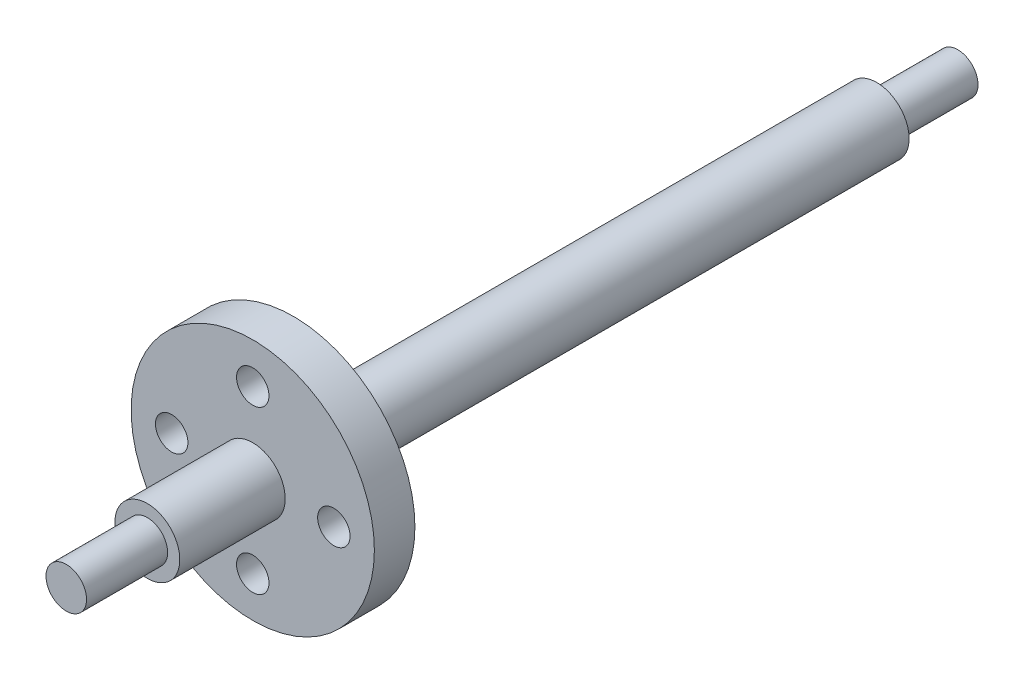
ISO-10303-21;
HEADER;
FILE_DESCRIPTION(('STEP AP214'),'2;1');
FILE_NAME('part.step','',(''),(''),'','','');
FILE_SCHEMA(('AUTOMOTIVE_DESIGN { 1 0 10303 214 1 1 1 1 }'));
ENDSEC;
DATA;
#1=APPLICATION_CONTEXT('core data for automotive mechanical design processes');
#2=APPLICATION_PROTOCOL_DEFINITION('international standard','automotive_design',2000,#1);
#3=PRODUCT_CONTEXT('',#1,'mechanical');
#4=PRODUCT('Part','Part','',(#3));
#5=PRODUCT_RELATED_PRODUCT_CATEGORY('part','',(#4));
#6=PRODUCT_DEFINITION_FORMATION('','',#4);
#7=PRODUCT_DEFINITION_CONTEXT('part definition',#1,'design');
#8=PRODUCT_DEFINITION('design','',#6,#7);
#9=PRODUCT_DEFINITION_SHAPE('','',#8);
#10=(LENGTH_UNIT() NAMED_UNIT(*) SI_UNIT(.MILLI.,.METRE.));
#11=(NAMED_UNIT(*) PLANE_ANGLE_UNIT() SI_UNIT($,.RADIAN.));
#12=(NAMED_UNIT(*) SI_UNIT($,.STERADIAN.) SOLID_ANGLE_UNIT());
#13=UNCERTAINTY_MEASURE_WITH_UNIT(LENGTH_MEASURE(1.E-05),#10,'distance_accuracy_value','');
#14=(GEOMETRIC_REPRESENTATION_CONTEXT(3) GLOBAL_UNCERTAINTY_ASSIGNED_CONTEXT((#13)) GLOBAL_UNIT_ASSIGNED_CONTEXT((#10,
#11,#12)) REPRESENTATION_CONTEXT('',''));
#15=CARTESIAN_POINT('',(0.,0.,0.));
#16=DIRECTION('',(0.,0.,1.));
#17=DIRECTION('',(1.,0.,0.));
#18=AXIS2_PLACEMENT_3D('',#15,#16,#17);
#19=CARTESIAN_POINT('',(0.,0.,109.95));
#20=DIRECTION('',(0.,0.,-1.));
#21=DIRECTION('',(-1.,0.,0.));
#22=AXIS2_PLACEMENT_3D('',#19,#20,#21);
#23=CYLINDRICAL_SURFACE('',#22,4.);
#24=CARTESIAN_POINT('',(0.,0.,86.95));
#25=DIRECTION('',(0.,0.,1.));
#26=DIRECTION('',(1.,0.,0.));
#27=AXIS2_PLACEMENT_3D('',#24,#25,#26);
#28=CIRCLE('',#27,4.);
#29=CARTESIAN_POINT('',(4.,0.,86.95));
#30=VERTEX_POINT('',#29);
#31=EDGE_CURVE('E44',#30,#30,#28,.T.);
#32=ORIENTED_EDGE('',*,*,#31,.T.);
#33=EDGE_LOOP('',(#32));
#34=FACE_BOUND('',#33,.T.);
#35=CARTESIAN_POINT('',(0.,0.,99.95));
#36=DIRECTION('',(0.,0.,-1.));
#37=DIRECTION('',(-1.,0.,0.));
#38=AXIS2_PLACEMENT_3D('',#35,#36,#37);
#39=CIRCLE('',#38,4.);
#40=CARTESIAN_POINT('',(-4.,0.,99.95));
#41=VERTEX_POINT('',#40);
#42=EDGE_CURVE('E61',#41,#41,#39,.T.);
#43=ORIENTED_EDGE('',*,*,#42,.T.);
#44=EDGE_LOOP('',(#43));
#45=FACE_BOUND('',#44,.T.);
#46=ADVANCED_FACE('F41',(#34,#45),#23,.T.);
#47=CARTESIAN_POINT('',(0.,0.,99.95));
#48=DIRECTION('',(0.,0.,1.));
#49=DIRECTION('',(-1.,0.,0.));
#50=AXIS2_PLACEMENT_3D('',#47,#48,#49);
#51=PLANE('',#50);
#52=ORIENTED_EDGE('',*,*,#42,.F.);
#53=EDGE_LOOP('',(#52));
#54=FACE_BOUND('',#53,.T.);
#55=CARTESIAN_POINT('',(0.,0.,99.95));
#56=DIRECTION('',(0.,0.,-1.));
#57=DIRECTION('',(-1.,0.,0.));
#58=AXIS2_PLACEMENT_3D('',#55,#56,#57);
#59=CIRCLE('',#58,2.5);
#60=CARTESIAN_POINT('',(-2.5,0.,99.95));
#61=VERTEX_POINT('',#60);
#62=EDGE_CURVE('E68',#61,#61,#59,.T.);
#63=ORIENTED_EDGE('',*,*,#62,.T.);
#64=EDGE_LOOP('',(#63));
#65=FACE_BOUND('',#64,.T.);
#66=ADVANCED_FACE('F139',(#54,#65),#51,.T.);
#67=CARTESIAN_POINT('',(0.,0.,99.95));
#68=DIRECTION('',(0.,0.,1.));
#69=DIRECTION('',(1.,0.,0.));
#70=AXIS2_PLACEMENT_3D('',#67,#68,#69);
#71=CYLINDRICAL_SURFACE('',#70,2.5);
#72=ORIENTED_EDGE('',*,*,#62,.F.);
#73=EDGE_LOOP('',(#72));
#74=FACE_BOUND('',#73,.T.);
#75=CARTESIAN_POINT('',(0.,0.,109.95));
#76=DIRECTION('',(0.,0.,-1.));
#77=DIRECTION('',(-1.,0.,0.));
#78=AXIS2_PLACEMENT_3D('',#75,#76,#77);
#79=CIRCLE('',#78,2.5);
#80=CARTESIAN_POINT('',(-2.5,0.,109.95));
#81=VERTEX_POINT('',#80);
#82=EDGE_CURVE('E69',#81,#81,#79,.T.);
#83=ORIENTED_EDGE('',*,*,#82,.T.);
#84=EDGE_LOOP('',(#83));
#85=FACE_BOUND('',#84,.T.);
#86=ADVANCED_FACE('F132',(#74,#85),#71,.T.);
#87=CARTESIAN_POINT('',(0.,0.,109.95));
#88=DIRECTION('',(0.,0.,1.));
#89=DIRECTION('',(1.,0.,0.));
#90=AXIS2_PLACEMENT_3D('',#87,#88,#89);
#91=PLANE('',#90);
#92=ORIENTED_EDGE('',*,*,#82,.F.);
#93=EDGE_LOOP('',(#92));
#94=FACE_BOUND('',#93,.T.);
#95=ADVANCED_FACE('F123',(#94),#91,.T.);
#96=CARTESIAN_POINT('',(0.,0.,86.95));
#97=DIRECTION('',(0.,0.,1.));
#98=DIRECTION('',(1.,0.,0.));
#99=AXIS2_PLACEMENT_3D('',#96,#97,#98);
#100=PLANE('',#99);
#101=ORIENTED_EDGE('',*,*,#31,.F.);
#102=EDGE_LOOP('',(#101));
#103=FACE_BOUND('',#102,.T.);
#104=CARTESIAN_POINT('',(5.64760248210638E-13,-10.,86.95));
#105=DIRECTION('',(0.,0.,1.));
#106=DIRECTION('',(1.,0.,0.));
#107=AXIS2_PLACEMENT_3D('',#104,#105,#106);
#108=CIRCLE('',#107,2.00000000000061);
#109=CARTESIAN_POINT('',(2.00000000000117,-10.,86.95));
#110=VERTEX_POINT('',#109);
#111=EDGE_CURVE('E97',#110,#110,#108,.T.);
#112=ORIENTED_EDGE('',*,*,#111,.F.);
#113=EDGE_LOOP('',(#112));
#114=FACE_BOUND('',#113,.T.);
#115=CARTESIAN_POINT('',(0.,10.,86.95));
#116=DIRECTION('',(0.,0.,1.));
#117=DIRECTION('',(1.,0.,0.));
#118=AXIS2_PLACEMENT_3D('',#115,#116,#117);
#119=CIRCLE('',#118,2.);
#120=CARTESIAN_POINT('',(2.,10.,86.95));
#121=VERTEX_POINT('',#120);
#122=EDGE_CURVE('E81',#121,#121,#119,.T.);
#123=ORIENTED_EDGE('',*,*,#122,.F.);
#124=EDGE_LOOP('',(#123));
#125=FACE_BOUND('',#124,.T.);
#126=CARTESIAN_POINT('',(0.,0.,86.95));
#127=DIRECTION('',(0.,0.,1.));
#128=DIRECTION('',(1.,0.,0.));
#129=AXIS2_PLACEMENT_3D('',#126,#127,#128);
#130=CIRCLE('',#129,15.);
#131=CARTESIAN_POINT('',(15.,0.,86.95));
#132=VERTEX_POINT('',#131);
#133=EDGE_CURVE('E80',#132,#132,#130,.T.);
#134=ORIENTED_EDGE('',*,*,#133,.T.);
#135=EDGE_LOOP('',(#134));
#136=FACE_BOUND('',#135,.T.);
#137=CARTESIAN_POINT('',(10.0000000000003,2.82380124105319E-13,86.95));
#138=DIRECTION('',(0.,0.,1.));
#139=DIRECTION('',(1.,0.,0.));
#140=AXIS2_PLACEMENT_3D('',#137,#138,#139);
#141=CIRCLE('',#140,2.00000000000022);
#142=CARTESIAN_POINT('',(12.0000000000005,2.82380124105319E-13,86.95));
#143=VERTEX_POINT('',#142);
#144=EDGE_CURVE('E89',#143,#143,#141,.T.);
#145=ORIENTED_EDGE('',*,*,#144,.F.);
#146=EDGE_LOOP('',(#145));
#147=FACE_BOUND('',#146,.T.);
#148=CARTESIAN_POINT('',(-9.99999999999972,-2.83604770904466E-13,86.95));
#149=DIRECTION('',(0.,0.,1.));
#150=DIRECTION('',(1.,0.,0.));
#151=AXIS2_PLACEMENT_3D('',#148,#149,#150);
#152=CIRCLE('',#151,2.00000000000045);
#153=CARTESIAN_POINT('',(-7.99999999999927,-2.83604770904466E-13,86.95));
#154=VERTEX_POINT('',#153);
#155=EDGE_CURVE('E105',#154,#154,#152,.T.);
#156=ORIENTED_EDGE('',*,*,#155,.F.);
#157=EDGE_LOOP('',(#156));
#158=FACE_BOUND('',#157,.T.);
#159=ADVANCED_FACE('F120',(#103,#114,#125,#136,#147,#158),#100,.T.);
#160=CARTESIAN_POINT('',(0.,0.,81.95));
#161=DIRECTION('',(0.,0.,1.));
#162=DIRECTION('',(1.,0.,0.));
#163=AXIS2_PLACEMENT_3D('',#160,#161,#162);
#164=PLANE('',#163);
#165=CARTESIAN_POINT('',(0.,0.,81.95));
#166=DIRECTION('',(0.,0.,1.));
#167=DIRECTION('',(1.,0.,0.));
#168=AXIS2_PLACEMENT_3D('',#165,#166,#167);
#169=CIRCLE('',#168,4.);
#170=CARTESIAN_POINT('',(4.,0.,81.95));
#171=VERTEX_POINT('',#170);
#172=EDGE_CURVE('E10',#171,#171,#169,.T.);
#173=ORIENTED_EDGE('',*,*,#172,.T.);
#174=EDGE_LOOP('',(#173));
#175=FACE_BOUND('',#174,.T.);
#176=CARTESIAN_POINT('',(0.,0.,81.95));
#177=DIRECTION('',(0.,0.,1.));
#178=DIRECTION('',(1.,0.,0.));
#179=AXIS2_PLACEMENT_3D('',#176,#177,#178);
#180=CIRCLE('',#179,15.);
#181=CARTESIAN_POINT('',(15.,0.,81.95));
#182=VERTEX_POINT('',#181);
#183=EDGE_CURVE('E76',#182,#182,#180,.T.);
#184=ORIENTED_EDGE('',*,*,#183,.F.);
#185=EDGE_LOOP('',(#184));
#186=FACE_BOUND('',#185,.T.);
#187=CARTESIAN_POINT('',(0.,10.,81.95));
#188=DIRECTION('',(0.,0.,1.));
#189=DIRECTION('',(1.,0.,0.));
#190=AXIS2_PLACEMENT_3D('',#187,#188,#189);
#191=CIRCLE('',#190,2.);
#192=CARTESIAN_POINT('',(2.,10.,81.95));
#193=VERTEX_POINT('',#192);
#194=EDGE_CURVE('E85',#193,#193,#191,.T.);
#195=ORIENTED_EDGE('',*,*,#194,.T.);
#196=EDGE_LOOP('',(#195));
#197=FACE_BOUND('',#196,.T.);
#198=CARTESIAN_POINT('',(10.0000000000003,2.82380124105319E-13,81.95));
#199=DIRECTION('',(0.,0.,1.));
#200=DIRECTION('',(1.,0.,0.));
#201=AXIS2_PLACEMENT_3D('',#198,#199,#200);
#202=CIRCLE('',#201,2.00000000000022);
#203=CARTESIAN_POINT('',(12.0000000000005,2.82380124105319E-13,81.95));
#204=VERTEX_POINT('',#203);
#205=EDGE_CURVE('E93',#204,#204,#202,.T.);
#206=ORIENTED_EDGE('',*,*,#205,.T.);
#207=EDGE_LOOP('',(#206));
#208=FACE_BOUND('',#207,.T.);
#209=CARTESIAN_POINT('',(5.64760248210638E-13,-10.,81.95));
#210=DIRECTION('',(0.,0.,1.));
#211=DIRECTION('',(1.,0.,0.));
#212=AXIS2_PLACEMENT_3D('',#209,#210,#211);
#213=CIRCLE('',#212,2.00000000000061);
#214=CARTESIAN_POINT('',(2.00000000000117,-10.,81.95));
#215=VERTEX_POINT('',#214);
#216=EDGE_CURVE('E101',#215,#215,#213,.T.);
#217=ORIENTED_EDGE('',*,*,#216,.T.);
#218=EDGE_LOOP('',(#217));
#219=FACE_BOUND('',#218,.T.);
#220=CARTESIAN_POINT('',(-9.99999999999972,-2.83604770904466E-13,81.95));
#221=DIRECTION('',(0.,0.,1.));
#222=DIRECTION('',(1.,0.,0.));
#223=AXIS2_PLACEMENT_3D('',#220,#221,#222);
#224=CIRCLE('',#223,2.00000000000045);
#225=CARTESIAN_POINT('',(-7.99999999999927,-2.83604770904466E-13,81.95));
#226=VERTEX_POINT('',#225);
#227=EDGE_CURVE('E109',#226,#226,#224,.T.);
#228=ORIENTED_EDGE('',*,*,#227,.T.);
#229=EDGE_LOOP('',(#228));
#230=FACE_BOUND('',#229,.T.);
#231=ADVANCED_FACE('F122',(#175,#186,#197,#208,#219,#230),#164,.F.);
#232=CARTESIAN_POINT('',(0.,0.,86.95));
#233=DIRECTION('',(0.,0.,-1.));
#234=DIRECTION('',(-1.,0.,0.));
#235=AXIS2_PLACEMENT_3D('',#232,#233,#234);
#236=CYLINDRICAL_SURFACE('',#235,15.);
#237=ORIENTED_EDGE('',*,*,#133,.F.);
#238=EDGE_LOOP('',(#237));
#239=FACE_BOUND('',#238,.T.);
#240=ORIENTED_EDGE('',*,*,#183,.T.);
#241=EDGE_LOOP('',(#240));
#242=FACE_BOUND('',#241,.T.);
#243=ADVANCED_FACE('F130',(#239,#242),#236,.T.);
#244=CARTESIAN_POINT('',(0.,10.,86.95));
#245=DIRECTION('',(0.,0.,-1.));
#246=DIRECTION('',(-1.,0.,0.));
#247=AXIS2_PLACEMENT_3D('',#244,#245,#246);
#248=CYLINDRICAL_SURFACE('',#247,2.);
#249=ORIENTED_EDGE('',*,*,#122,.T.);
#250=EDGE_LOOP('',(#249));
#251=FACE_BOUND('',#250,.T.);
#252=ORIENTED_EDGE('',*,*,#194,.F.);
#253=EDGE_LOOP('',(#252));
#254=FACE_BOUND('',#253,.T.);
#255=ADVANCED_FACE('F185',(#251,#254),#248,.F.);
#256=CARTESIAN_POINT('',(10.0000000000003,2.82380124105319E-13,86.95));
#257=DIRECTION('',(0.,0.,-1.));
#258=DIRECTION('',(-1.,0.,0.));
#259=AXIS2_PLACEMENT_3D('',#256,#257,#258);
#260=CYLINDRICAL_SURFACE('',#259,2.00000000000022);
#261=ORIENTED_EDGE('',*,*,#144,.T.);
#262=EDGE_LOOP('',(#261));
#263=FACE_BOUND('',#262,.T.);
#264=ORIENTED_EDGE('',*,*,#205,.F.);
#265=EDGE_LOOP('',(#264));
#266=FACE_BOUND('',#265,.T.);
#267=ADVANCED_FACE('F180',(#263,#266),#260,.F.);
#268=CARTESIAN_POINT('',(5.64760248210638E-13,-10.,86.95));
#269=DIRECTION('',(0.,0.,-1.));
#270=DIRECTION('',(-1.,0.,0.));
#271=AXIS2_PLACEMENT_3D('',#268,#269,#270);
#272=CYLINDRICAL_SURFACE('',#271,2.00000000000061);
#273=ORIENTED_EDGE('',*,*,#111,.T.);
#274=EDGE_LOOP('',(#273));
#275=FACE_BOUND('',#274,.T.);
#276=ORIENTED_EDGE('',*,*,#216,.F.);
#277=EDGE_LOOP('',(#276));
#278=FACE_BOUND('',#277,.T.);
#279=ADVANCED_FACE('F173',(#275,#278),#272,.F.);
#280=CARTESIAN_POINT('',(-9.99999999999972,-2.83604770904466E-13,86.95));
#281=DIRECTION('',(0.,0.,-1.));
#282=DIRECTION('',(-1.,0.,0.));
#283=AXIS2_PLACEMENT_3D('',#280,#281,#282);
#284=CYLINDRICAL_SURFACE('',#283,2.00000000000045);
#285=ORIENTED_EDGE('',*,*,#155,.T.);
#286=EDGE_LOOP('',(#285));
#287=FACE_BOUND('',#286,.T.);
#288=ORIENTED_EDGE('',*,*,#227,.F.);
#289=EDGE_LOOP('',(#288));
#290=FACE_BOUND('',#289,.T.);
#291=ADVANCED_FACE('F117',(#287,#290),#284,.F.);
#292=CARTESIAN_POINT('',(0.,0.,0.));
#293=DIRECTION('',(0.,0.,1.));
#294=DIRECTION('',(1.,0.,0.));
#295=AXIS2_PLACEMENT_3D('',#292,#293,#294);
#296=PLANE('',#295);
#297=CARTESIAN_POINT('',(0.,0.,0.));
#298=DIRECTION('',(0.,0.,-1.));
#299=DIRECTION('',(-1.,0.,0.));
#300=AXIS2_PLACEMENT_3D('',#297,#298,#299);
#301=CIRCLE('',#300,2.5);
#302=CARTESIAN_POINT('',(-2.5,0.,0.));
#303=VERTEX_POINT('',#302);
#304=EDGE_CURVE('E57',#303,#303,#301,.T.);
#305=ORIENTED_EDGE('',*,*,#304,.T.);
#306=EDGE_LOOP('',(#305));
#307=FACE_BOUND('',#306,.T.);
#308=ADVANCED_FACE('F164',(#307),#296,.F.);
#309=CARTESIAN_POINT('',(0.,0.,10.));
#310=DIRECTION('',(0.,0.,-1.));
#311=DIRECTION('',(-1.,0.,0.));
#312=AXIS2_PLACEMENT_3D('',#309,#310,#311);
#313=CYLINDRICAL_SURFACE('',#312,2.5);
#314=CARTESIAN_POINT('',(0.,0.,10.));
#315=DIRECTION('',(0.,0.,-1.));
#316=DIRECTION('',(-1.,0.,0.));
#317=AXIS2_PLACEMENT_3D('',#314,#315,#316);
#318=CIRCLE('',#317,2.5);
#319=CARTESIAN_POINT('',(-2.5,0.,10.));
#320=VERTEX_POINT('',#319);
#321=EDGE_CURVE('E54',#320,#320,#318,.T.);
#322=ORIENTED_EDGE('',*,*,#321,.T.);
#323=EDGE_LOOP('',(#322));
#324=FACE_BOUND('',#323,.T.);
#325=ORIENTED_EDGE('',*,*,#304,.F.);
#326=EDGE_LOOP('',(#325));
#327=FACE_BOUND('',#326,.T.);
#328=ADVANCED_FACE('F155',(#324,#327),#313,.T.);
#329=CARTESIAN_POINT('',(0.,0.,10.));
#330=DIRECTION('',(0.,0.,-1.));
#331=DIRECTION('',(-1.,0.,0.));
#332=AXIS2_PLACEMENT_3D('',#329,#330,#331);
#333=PLANE('',#332);
#334=ORIENTED_EDGE('',*,*,#321,.F.);
#335=EDGE_LOOP('',(#334));
#336=FACE_BOUND('',#335,.T.);
#337=CARTESIAN_POINT('',(0.,0.,10.));
#338=DIRECTION('',(0.,0.,-1.));
#339=DIRECTION('',(-1.,0.,0.));
#340=AXIS2_PLACEMENT_3D('',#337,#338,#339);
#341=CIRCLE('',#340,4.);
#342=CARTESIAN_POINT('',(-4.,0.,10.));
#343=VERTEX_POINT('',#342);
#344=EDGE_CURVE('E49',#343,#343,#341,.T.);
#345=ORIENTED_EDGE('',*,*,#344,.T.);
#346=EDGE_LOOP('',(#345));
#347=FACE_BOUND('',#346,.T.);
#348=ADVANCED_FACE('F150',(#336,#347),#333,.T.);
#349=ORIENTED_EDGE('',*,*,#344,.F.);
#350=EDGE_LOOP('',(#349));
#351=FACE_BOUND('',#350,.T.);
#352=ORIENTED_EDGE('',*,*,#172,.F.);
#353=EDGE_LOOP('',(#352));
#354=FACE_BOUND('',#353,.T.);
#355=ADVANCED_FACE('F141',(#351,#354),#23,.T.);
#356=CLOSED_SHELL('',(#46,#66,#86,#95,#159,#231,#243,#255,#267,#279,#291,#308,#328,#348,#355));
#357=MANIFOLD_SOLID_BREP('B2',#356);
#358=ADVANCED_BREP_SHAPE_REPRESENTATION('',(#18,#357),#14);
#359=SHAPE_DEFINITION_REPRESENTATION(#9,#358);
ENDSEC;
END-ISO-10303-21;
